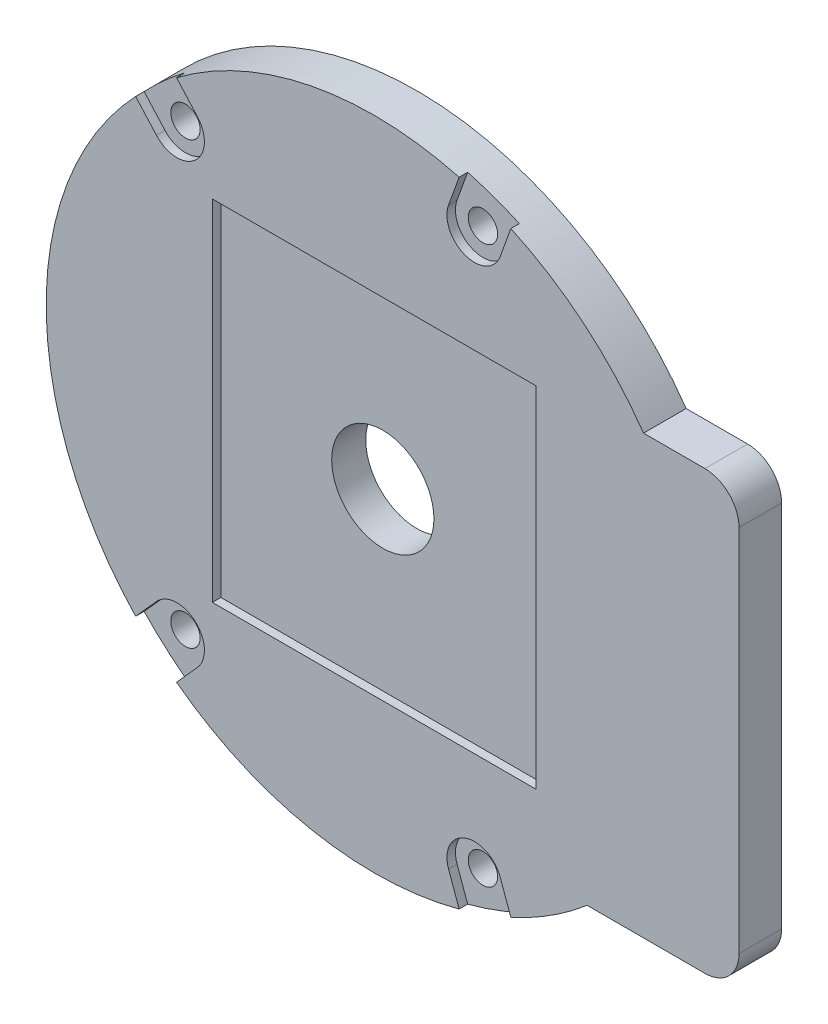
ISO-10303-21;
HEADER;
FILE_DESCRIPTION(('STEP AP214'),'2;1');
FILE_NAME('part.step','',(''),(''),'','','');
FILE_SCHEMA(('AUTOMOTIVE_DESIGN { 1 0 10303 214 1 1 1 1 }'));
ENDSEC;
DATA;
#1=APPLICATION_CONTEXT('core data for automotive mechanical design processes');
#2=APPLICATION_PROTOCOL_DEFINITION('international standard','automotive_design',2000,#1);
#3=PRODUCT_CONTEXT('',#1,'mechanical');
#4=PRODUCT('Part','Part','',(#3));
#5=PRODUCT_RELATED_PRODUCT_CATEGORY('part','',(#4));
#6=PRODUCT_DEFINITION_FORMATION('','',#4);
#7=PRODUCT_DEFINITION_CONTEXT('part definition',#1,'design');
#8=PRODUCT_DEFINITION('design','',#6,#7);
#9=PRODUCT_DEFINITION_SHAPE('','',#8);
#10=(LENGTH_UNIT() NAMED_UNIT(*) SI_UNIT(.MILLI.,.METRE.));
#11=(NAMED_UNIT(*) PLANE_ANGLE_UNIT() SI_UNIT($,.RADIAN.));
#12=(NAMED_UNIT(*) SI_UNIT($,.STERADIAN.) SOLID_ANGLE_UNIT());
#13=UNCERTAINTY_MEASURE_WITH_UNIT(LENGTH_MEASURE(1.E-05),#10,'distance_accuracy_value','');
#14=(GEOMETRIC_REPRESENTATION_CONTEXT(3) GLOBAL_UNCERTAINTY_ASSIGNED_CONTEXT((#13)) GLOBAL_UNIT_ASSIGNED_CONTEXT((#10,
#11,#12)) REPRESENTATION_CONTEXT('',''));
#15=CARTESIAN_POINT('',(0.,0.,0.));
#16=DIRECTION('',(0.,0.,1.));
#17=DIRECTION('',(1.,0.,0.));
#18=AXIS2_PLACEMENT_3D('',#15,#16,#17);
#19=CARTESIAN_POINT('',(0.,0.,4.));
#20=DIRECTION('',(0.,0.,1.));
#21=DIRECTION('',(1.,0.,0.));
#22=AXIS2_PLACEMENT_3D('',#19,#20,#21);
#23=PLANE('',#22);
#24=DIRECTION('',(0.338622846225682,-0.940922190201729,0.));
#25=VECTOR('',#24,1.);
#26=CARTESIAN_POINT('',(14.7846868274317,-31.5579413209222,4.));
#27=LINE('',#26,#25);
#28=CARTESIAN_POINT('',(14.7846868274317,-31.5579413209222,4.));
#29=VERTEX_POINT('',#28);
#30=CARTESIAN_POINT('',(16.0256343042209,-35.0061286798094,4.));
#31=VERTEX_POINT('',#30);
#32=EDGE_CURVE('E256',#29,#31,#27,.T.);
#33=ORIENTED_EDGE('',*,*,#32,.F.);
#34=CARTESIAN_POINT('',(11.7502127640311,-32.65,4.));
#35=DIRECTION('',(0.,0.,-1.));
#36=DIRECTION('',(-1.,0.,0.));
#37=AXIS2_PLACEMENT_3D('',#34,#35,#36);
#38=CIRCLE('',#37,3.225);
#39=CARTESIAN_POINT('',(8.71573870063056,-33.7420586790778,4.));
#40=VERTEX_POINT('',#39);
#41=EDGE_CURVE('E396',#40,#29,#38,.T.);
#42=ORIENTED_EDGE('',*,*,#41,.F.);
#43=DIRECTION('',(-0.338622846225681,0.940922190201729,0.));
#44=VECTOR('',#43,1.);
#45=CARTESIAN_POINT('',(8.71573870063056,-33.7420586790778,4.));
#46=LINE('',#45,#44);
#47=CARTESIAN_POINT('',(9.95668617741978,-37.1902460379651,4.));
#48=VERTEX_POINT('',#47);
#49=EDGE_CURVE('E850',#48,#40,#46,.T.);
#50=ORIENTED_EDGE('',*,*,#49,.F.);
#51=CARTESIAN_POINT('',(0.,0.,4.));
#52=DIRECTION('',(0.,0.,1.));
#53=DIRECTION('',(1.,0.,0.));
#54=AXIS2_PLACEMENT_3D('',#51,#52,#53);
#55=CIRCLE('',#54,38.5);
#56=EDGE_CURVE('E358',#48,#31,#55,.T.);
#57=ORIENTED_EDGE('',*,*,#56,.T.);
#58=EDGE_LOOP('',(#33,#42,#50,#57));
#59=FACE_BOUND('',#58,.T.);
#60=CARTESIAN_POINT('',(11.7502127640311,-32.65,4.));
#61=DIRECTION('',(0.,0.,1.));
#62=DIRECTION('',(1.,0.,0.));
#63=AXIS2_PLACEMENT_3D('',#60,#61,#62);
#64=CIRCLE('',#63,1.725);
#65=CARTESIAN_POINT('',(13.4752127640311,-32.65,4.));
#66=VERTEX_POINT('',#65);
#67=EDGE_CURVE('E440',#66,#66,#64,.T.);
#68=ORIENTED_EDGE('',*,*,#67,.F.);
#69=EDGE_LOOP('',(#68));
#70=FACE_BOUND('',#69,.T.);
#71=ADVANCED_FACE('F32',(#59,#70),#23,.T.);
#72=DIRECTION('',(-0.667434411909216,-0.744668587896253,0.));
#73=VECTOR('',#72,1.);
#74=CARTESIAN_POINT('',(-20.7584178972843,-27.9924759784072,4.));
#75=LINE('',#74,#73);
#76=CARTESIAN_POINT('',(-20.7584178972843,-27.9924759784072,4.));
#77=VERTEX_POINT('',#76);
#78=CARTESIAN_POINT('',(-23.2043575573303,-30.7214548866353,4.));
#79=VERTEX_POINT('',#78);
#80=EDGE_CURVE('E840',#77,#79,#75,.T.);
#81=ORIENTED_EDGE('',*,*,#80,.F.);
#82=CARTESIAN_POINT('',(-23.1599740932498,-25.84,4.));
#83=DIRECTION('',(0.,0.,-1.));
#84=DIRECTION('',(-1.,0.,0.));
#85=AXIS2_PLACEMENT_3D('',#82,#83,#84);
#86=CIRCLE('',#85,3.225);
#87=CARTESIAN_POINT('',(-25.5615302892152,-23.6875240215928,4.));
#88=VERTEX_POINT('',#87);
#89=EDGE_CURVE('E837',#88,#77,#86,.T.);
#90=ORIENTED_EDGE('',*,*,#89,.F.);
#91=DIRECTION('',(0.667434411909216,0.744668587896253,0.));
#92=VECTOR('',#91,1.);
#93=CARTESIAN_POINT('',(-25.5615302892152,-23.6875240215928,4.));
#94=LINE('',#93,#92);
#95=CARTESIAN_POINT('',(-28.0074699492611,-26.4165029298209,4.));
#96=VERTEX_POINT('',#95);
#97=EDGE_CURVE('E865',#96,#88,#94,.T.);
#98=ORIENTED_EDGE('',*,*,#97,.F.);
#99=EDGE_CURVE('E380',#96,#79,#55,.T.);
#100=ORIENTED_EDGE('',*,*,#99,.T.);
#101=EDGE_LOOP('',(#81,#90,#98,#100));
#102=FACE_BOUND('',#101,.T.);
#103=CARTESIAN_POINT('',(-23.1599740932498,-25.84,4.));
#104=DIRECTION('',(0.,0.,1.));
#105=DIRECTION('',(1.,0.,0.));
#106=AXIS2_PLACEMENT_3D('',#103,#104,#105);
#107=CIRCLE('',#106,1.725);
#108=CARTESIAN_POINT('',(-21.4349740932498,-25.84,4.));
#109=VERTEX_POINT('',#108);
#110=EDGE_CURVE('E444',#109,#109,#107,.T.);
#111=ORIENTED_EDGE('',*,*,#110,.F.);
#112=EDGE_LOOP('',(#111));
#113=FACE_BOUND('',#112,.T.);
#114=ADVANCED_FACE('F467',(#102,#113),#23,.T.);
#115=DIRECTION('',(-0.667434411909216,0.744668587896253,0.));
#116=VECTOR('',#115,1.);
#117=CARTESIAN_POINT('',(-25.5615302892152,23.6875240215928,4.));
#118=LINE('',#117,#116);
#119=CARTESIAN_POINT('',(-25.5615302892152,23.6875240215928,4.));
#120=VERTEX_POINT('',#119);
#121=CARTESIAN_POINT('',(-28.0074699492611,26.4165029298209,4.));
#122=VERTEX_POINT('',#121);
#123=EDGE_CURVE('E823',#120,#122,#118,.T.);
#124=ORIENTED_EDGE('',*,*,#123,.F.);
#125=CARTESIAN_POINT('',(-23.1599740932498,25.84,4.));
#126=DIRECTION('',(0.,0.,-1.));
#127=DIRECTION('',(1.,0.,0.));
#128=AXIS2_PLACEMENT_3D('',#125,#126,#127);
#129=CIRCLE('',#128,3.225);
#130=CARTESIAN_POINT('',(-20.7584178972843,27.9924759784072,4.));
#131=VERTEX_POINT('',#130);
#132=EDGE_CURVE('E302',#131,#120,#129,.T.);
#133=ORIENTED_EDGE('',*,*,#132,.F.);
#134=DIRECTION('',(0.667434411909216,-0.744668587896253,0.));
#135=VECTOR('',#134,1.);
#136=CARTESIAN_POINT('',(-20.7584178972843,27.9924759784072,4.));
#137=LINE('',#136,#135);
#138=CARTESIAN_POINT('',(-23.2043575573303,30.7214548866353,4.));
#139=VERTEX_POINT('',#138);
#140=EDGE_CURVE('E308',#139,#131,#137,.T.);
#141=ORIENTED_EDGE('',*,*,#140,.F.);
#142=EDGE_CURVE('E370',#139,#122,#55,.T.);
#143=ORIENTED_EDGE('',*,*,#142,.T.);
#144=EDGE_LOOP('',(#124,#133,#141,#143));
#145=FACE_BOUND('',#144,.T.);
#146=CARTESIAN_POINT('',(-23.1599740932498,25.84,4.));
#147=DIRECTION('',(0.,0.,1.));
#148=DIRECTION('',(1.,0.,0.));
#149=AXIS2_PLACEMENT_3D('',#146,#147,#148);
#150=CIRCLE('',#149,1.725);
#151=CARTESIAN_POINT('',(-21.4349740932498,25.84,4.));
#152=VERTEX_POINT('',#151);
#153=EDGE_CURVE('E434',#152,#152,#150,.T.);
#154=ORIENTED_EDGE('',*,*,#153,.F.);
#155=EDGE_LOOP('',(#154));
#156=FACE_BOUND('',#155,.T.);
#157=ADVANCED_FACE('F473',(#145,#156),#23,.T.);
#158=DIRECTION('',(0.338622846225681,0.940922190201729,0.));
#159=VECTOR('',#158,1.);
#160=CARTESIAN_POINT('',(8.71573870063056,33.7420586790778,4.));
#161=LINE('',#160,#159);
#162=CARTESIAN_POINT('',(8.71573870063056,33.7420586790778,4.));
#163=VERTEX_POINT('',#162);
#164=CARTESIAN_POINT('',(9.95668617741978,37.1902460379651,4.));
#165=VERTEX_POINT('',#164);
#166=EDGE_CURVE('E299',#163,#165,#161,.T.);
#167=ORIENTED_EDGE('',*,*,#166,.F.);
#168=CARTESIAN_POINT('',(11.7502127640311,32.65,4.));
#169=DIRECTION('',(0.,0.,-1.));
#170=DIRECTION('',(1.,0.,0.));
#171=AXIS2_PLACEMENT_3D('',#168,#169,#170);
#172=CIRCLE('',#171,3.225);
#173=CARTESIAN_POINT('',(14.7846868274317,31.5579413209222,4.));
#174=VERTEX_POINT('',#173);
#175=EDGE_CURVE('E296',#174,#163,#172,.T.);
#176=ORIENTED_EDGE('',*,*,#175,.F.);
#177=DIRECTION('',(-0.338622846225682,-0.940922190201729,0.));
#178=VECTOR('',#177,1.);
#179=CARTESIAN_POINT('',(14.7846868274317,31.5579413209222,4.));
#180=LINE('',#179,#178);
#181=CARTESIAN_POINT('',(16.0256343042209,35.0061286798094,4.));
#182=VERTEX_POINT('',#181);
#183=EDGE_CURVE('E226',#182,#174,#180,.T.);
#184=ORIENTED_EDGE('',*,*,#183,.F.);
#185=EDGE_CURVE('E365',#182,#165,#55,.T.);
#186=ORIENTED_EDGE('',*,*,#185,.T.);
#187=EDGE_LOOP('',(#167,#176,#184,#186));
#188=FACE_BOUND('',#187,.T.);
#189=CARTESIAN_POINT('',(11.7502127640311,32.65,4.));
#190=DIRECTION('',(0.,0.,1.));
#191=DIRECTION('',(1.,0.,0.));
#192=AXIS2_PLACEMENT_3D('',#189,#190,#191);
#193=CIRCLE('',#192,1.725);
#194=CARTESIAN_POINT('',(13.4752127640311,32.65,4.));
#195=VERTEX_POINT('',#194);
#196=EDGE_CURVE('E428',#195,#195,#193,.T.);
#197=ORIENTED_EDGE('',*,*,#196,.F.);
#198=EDGE_LOOP('',(#197));
#199=FACE_BOUND('',#198,.T.);
#200=ADVANCED_FACE('F469',(#188,#199),#23,.T.);
#201=CARTESIAN_POINT('',(0.,0.,0.));
#202=DIRECTION('',(0.,0.,1.));
#203=DIRECTION('',(1.,0.,0.));
#204=AXIS2_PLACEMENT_3D('',#201,#202,#203);
#205=PLANE('',#204);
#206=CARTESIAN_POINT('',(0.,0.,0.));
#207=DIRECTION('',(0.,0.,-1.));
#208=DIRECTION('',(-1.,0.,0.));
#209=AXIS2_PLACEMENT_3D('',#206,#207,#208);
#210=CIRCLE('',#209,6.);
#211=CARTESIAN_POINT('',(-6.,0.,0.));
#212=VERTEX_POINT('',#211);
#213=EDGE_CURVE('E320',#212,#212,#210,.T.);
#214=ORIENTED_EDGE('',*,*,#213,.F.);
#215=EDGE_LOOP('',(#214));
#216=FACE_BOUND('',#215,.T.);
#217=CARTESIAN_POINT('',(-23.1599740932498,25.84,0.));
#218=DIRECTION('',(0.,0.,1.));
#219=DIRECTION('',(1.,0.,0.));
#220=AXIS2_PLACEMENT_3D('',#217,#218,#219);
#221=CIRCLE('',#220,1.725);
#222=CARTESIAN_POINT('',(-21.4349740932498,25.84,0.));
#223=VERTEX_POINT('',#222);
#224=EDGE_CURVE('E431',#223,#223,#221,.T.);
#225=ORIENTED_EDGE('',*,*,#224,.T.);
#226=EDGE_LOOP('',(#225));
#227=FACE_BOUND('',#226,.T.);
#228=CARTESIAN_POINT('',(-23.1599740932498,-25.84,0.));
#229=DIRECTION('',(0.,0.,1.));
#230=DIRECTION('',(1.,0.,0.));
#231=AXIS2_PLACEMENT_3D('',#228,#229,#230);
#232=CIRCLE('',#231,1.725);
#233=CARTESIAN_POINT('',(-21.4349740932498,-25.84,0.));
#234=VERTEX_POINT('',#233);
#235=EDGE_CURVE('E374',#234,#234,#232,.T.);
#236=ORIENTED_EDGE('',*,*,#235,.T.);
#237=EDGE_LOOP('',(#236));
#238=FACE_BOUND('',#237,.T.);
#239=DIRECTION('',(-1.,0.,0.));
#240=VECTOR('',#239,1.);
#241=CARTESIAN_POINT('',(31.5950945559592,22.,0.));
#242=LINE('',#241,#240);
#243=CARTESIAN_POINT('',(38.8,22.,0.));
#244=VERTEX_POINT('',#243);
#245=CARTESIAN_POINT('',(31.5950945559592,22.,0.));
#246=VERTEX_POINT('',#245);
#247=EDGE_CURVE('E353',#244,#246,#242,.T.);
#248=ORIENTED_EDGE('',*,*,#247,.F.);
#249=CARTESIAN_POINT('',(38.8,18.,0.));
#250=DIRECTION('',(0.,0.,1.));
#251=DIRECTION('',(1.,0.,0.));
#252=AXIS2_PLACEMENT_3D('',#249,#250,#251);
#253=CIRCLE('',#252,4.);
#254=CARTESIAN_POINT('',(42.8,18.,0.));
#255=VERTEX_POINT('',#254);
#256=EDGE_CURVE('E327',#244,#255,#253,.F.);
#257=ORIENTED_EDGE('',*,*,#256,.T.);
#258=DIRECTION('',(0.,1.,0.));
#259=VECTOR('',#258,1.);
#260=CARTESIAN_POINT('',(42.8,22.,0.));
#261=LINE('',#260,#259);
#262=CARTESIAN_POINT('',(42.8,-25.3,0.));
#263=VERTEX_POINT('',#262);
#264=EDGE_CURVE('E351',#263,#255,#261,.T.);
#265=ORIENTED_EDGE('',*,*,#264,.F.);
#266=CARTESIAN_POINT('',(38.8,-25.3,0.));
#267=DIRECTION('',(0.,0.,1.));
#268=DIRECTION('',(1.,0.,0.));
#269=AXIS2_PLACEMENT_3D('',#266,#267,#268);
#270=CIRCLE('',#269,4.);
#271=CARTESIAN_POINT('',(38.8,-29.3,0.));
#272=VERTEX_POINT('',#271);
#273=EDGE_CURVE('E324',#263,#272,#270,.F.);
#274=ORIENTED_EDGE('',*,*,#273,.T.);
#275=DIRECTION('',(1.,0.,0.));
#276=VECTOR('',#275,1.);
#277=CARTESIAN_POINT('',(42.8,-29.3,0.));
#278=LINE('',#277,#276);
#279=CARTESIAN_POINT('',(24.9751876869824,-29.3,0.));
#280=VERTEX_POINT('',#279);
#281=EDGE_CURVE('E356',#280,#272,#278,.T.);
#282=ORIENTED_EDGE('',*,*,#281,.F.);
#283=CARTESIAN_POINT('',(0.,0.,0.));
#284=DIRECTION('',(0.,0.,1.));
#285=DIRECTION('',(1.,0.,0.));
#286=AXIS2_PLACEMENT_3D('',#283,#284,#285);
#287=CIRCLE('',#286,38.5);
#288=EDGE_CURVE('E360',#246,#280,#287,.T.);
#289=ORIENTED_EDGE('',*,*,#288,.F.);
#290=EDGE_LOOP('',(#248,#257,#265,#274,#282,#289));
#291=FACE_BOUND('',#290,.T.);
#292=CARTESIAN_POINT('',(11.7502127640311,-32.65,0.));
#293=DIRECTION('',(0.,0.,1.));
#294=DIRECTION('',(1.,0.,0.));
#295=AXIS2_PLACEMENT_3D('',#292,#293,#294);
#296=CIRCLE('',#295,1.725);
#297=CARTESIAN_POINT('',(13.4752127640311,-32.65,0.));
#298=VERTEX_POINT('',#297);
#299=EDGE_CURVE('E437',#298,#298,#296,.T.);
#300=ORIENTED_EDGE('',*,*,#299,.T.);
#301=EDGE_LOOP('',(#300));
#302=FACE_BOUND('',#301,.T.);
#303=CARTESIAN_POINT('',(11.7502127640311,32.65,0.));
#304=DIRECTION('',(0.,0.,1.));
#305=DIRECTION('',(1.,0.,0.));
#306=AXIS2_PLACEMENT_3D('',#303,#304,#305);
#307=CIRCLE('',#306,1.725);
#308=CARTESIAN_POINT('',(13.4752127640311,32.65,0.));
#309=VERTEX_POINT('',#308);
#310=EDGE_CURVE('E389',#309,#309,#307,.T.);
#311=ORIENTED_EDGE('',*,*,#310,.T.);
#312=EDGE_LOOP('',(#311));
#313=FACE_BOUND('',#312,.T.);
#314=ADVANCED_FACE('F349',(#216,#227,#238,#291,#302,#313),#205,.F.);
#315=CARTESIAN_POINT('',(0.,0.,4.));
#316=DIRECTION('',(0.,0.,-1.));
#317=DIRECTION('',(-1.,0.,0.));
#318=AXIS2_PLACEMENT_3D('',#315,#316,#317);
#319=CYLINDRICAL_SURFACE('',#318,38.5);
#320=ORIENTED_EDGE('',*,*,#288,.T.);
#321=DIRECTION('',(0.,0.,-1.));
#322=VECTOR('',#321,1.);
#323=CARTESIAN_POINT('',(24.9751876869824,-29.3,4.));
#324=LINE('',#323,#322);
#325=CARTESIAN_POINT('',(24.9751876869824,-29.3,5.));
#326=VERTEX_POINT('',#325);
#327=EDGE_CURVE('E325',#326,#280,#324,.T.);
#328=ORIENTED_EDGE('',*,*,#327,.F.);
#329=CARTESIAN_POINT('',(0.,0.,5.));
#330=DIRECTION('',(0.,0.,1.));
#331=DIRECTION('',(1.,0.,0.));
#332=AXIS2_PLACEMENT_3D('',#329,#330,#331);
#333=CIRCLE('',#332,38.5);
#334=CARTESIAN_POINT('',(16.0256343042209,-35.0061286798094,5.));
#335=VERTEX_POINT('',#334);
#336=EDGE_CURVE('E286',#335,#326,#333,.T.);
#337=ORIENTED_EDGE('',*,*,#336,.F.);
#338=DIRECTION('',(0.,0.,-1.));
#339=VECTOR('',#338,1.);
#340=CARTESIAN_POINT('',(16.0256343042209,-35.0061286798094,5.));
#341=LINE('',#340,#339);
#342=EDGE_CURVE('E295',#335,#31,#341,.T.);
#343=ORIENTED_EDGE('',*,*,#342,.T.);
#344=ORIENTED_EDGE('',*,*,#56,.F.);
#345=DIRECTION('',(0.,0.,-1.));
#346=VECTOR('',#345,1.);
#347=CARTESIAN_POINT('',(9.95668617741978,-37.1902460379651,5.));
#348=LINE('',#347,#346);
#349=CARTESIAN_POINT('',(9.95668617741978,-37.1902460379651,5.));
#350=VERTEX_POINT('',#349);
#351=EDGE_CURVE('E408',#350,#48,#348,.T.);
#352=ORIENTED_EDGE('',*,*,#351,.F.);
#353=CARTESIAN_POINT('',(0.,0.,5.));
#354=DIRECTION('',(0.,0.,1.));
#355=DIRECTION('',(1.,0.,0.));
#356=AXIS2_PLACEMENT_3D('',#353,#354,#355);
#357=CIRCLE('',#356,38.5);
#358=CARTESIAN_POINT('',(-23.2043575573303,-30.7214548866353,5.));
#359=VERTEX_POINT('',#358);
#360=EDGE_CURVE('E278',#359,#350,#357,.T.);
#361=ORIENTED_EDGE('',*,*,#360,.F.);
#362=DIRECTION('',(0.,0.,-1.));
#363=VECTOR('',#362,1.);
#364=CARTESIAN_POINT('',(-23.2043575573303,-30.7214548866353,5.));
#365=LINE('',#364,#363);
#366=EDGE_CURVE('E413',#359,#79,#365,.T.);
#367=ORIENTED_EDGE('',*,*,#366,.T.);
#368=ORIENTED_EDGE('',*,*,#99,.F.);
#369=DIRECTION('',(0.,0.,-1.));
#370=VECTOR('',#369,1.);
#371=CARTESIAN_POINT('',(-28.0074699492611,-26.4165029298209,5.));
#372=LINE('',#371,#370);
#373=CARTESIAN_POINT('',(-28.0074699492611,-26.4165029298209,5.));
#374=VERTEX_POINT('',#373);
#375=EDGE_CURVE('E416',#374,#96,#372,.T.);
#376=ORIENTED_EDGE('',*,*,#375,.F.);
#377=CARTESIAN_POINT('',(0.,0.,5.));
#378=DIRECTION('',(0.,0.,1.));
#379=DIRECTION('',(1.,0.,0.));
#380=AXIS2_PLACEMENT_3D('',#377,#378,#379);
#381=CIRCLE('',#380,38.5);
#382=CARTESIAN_POINT('',(-28.0074699492611,26.4165029298209,5.));
#383=VERTEX_POINT('',#382);
#384=EDGE_CURVE('E270',#383,#374,#381,.T.);
#385=ORIENTED_EDGE('',*,*,#384,.F.);
#386=DIRECTION('',(0.,0.,-1.));
#387=VECTOR('',#386,1.);
#388=CARTESIAN_POINT('',(-28.0074699492611,26.4165029298209,5.));
#389=LINE('',#388,#387);
#390=EDGE_CURVE('E421',#383,#122,#389,.T.);
#391=ORIENTED_EDGE('',*,*,#390,.T.);
#392=ORIENTED_EDGE('',*,*,#142,.F.);
#393=DIRECTION('',(0.,0.,-1.));
#394=VECTOR('',#393,1.);
#395=CARTESIAN_POINT('',(-23.2043575573303,30.7214548866353,5.));
#396=LINE('',#395,#394);
#397=CARTESIAN_POINT('',(-23.2043575573303,30.7214548866353,5.));
#398=VERTEX_POINT('',#397);
#399=EDGE_CURVE('E315',#398,#139,#396,.T.);
#400=ORIENTED_EDGE('',*,*,#399,.F.);
#401=CARTESIAN_POINT('',(0.,0.,5.));
#402=DIRECTION('',(0.,0.,1.));
#403=DIRECTION('',(1.,0.,0.));
#404=AXIS2_PLACEMENT_3D('',#401,#402,#403);
#405=CIRCLE('',#404,38.5);
#406=CARTESIAN_POINT('',(9.95668617741978,37.1902460379651,5.));
#407=VERTEX_POINT('',#406);
#408=EDGE_CURVE('E262',#407,#398,#405,.T.);
#409=ORIENTED_EDGE('',*,*,#408,.F.);
#410=DIRECTION('',(0.,0.,-1.));
#411=VECTOR('',#410,1.);
#412=CARTESIAN_POINT('',(9.95668617741978,37.1902460379651,5.));
#413=LINE('',#412,#411);
#414=EDGE_CURVE('E311',#407,#165,#413,.T.);
#415=ORIENTED_EDGE('',*,*,#414,.T.);
#416=ORIENTED_EDGE('',*,*,#185,.F.);
#417=DIRECTION('',(0.,0.,-1.));
#418=VECTOR('',#417,1.);
#419=CARTESIAN_POINT('',(16.0256343042209,35.0061286798094,5.));
#420=LINE('',#419,#418);
#421=CARTESIAN_POINT('',(16.0256343042209,35.0061286798094,5.));
#422=VERTEX_POINT('',#421);
#423=EDGE_CURVE('E386',#422,#182,#420,.T.);
#424=ORIENTED_EDGE('',*,*,#423,.F.);
#425=CARTESIAN_POINT('',(0.,0.,5.));
#426=DIRECTION('',(0.,0.,1.));
#427=DIRECTION('',(1.,0.,0.));
#428=AXIS2_PLACEMENT_3D('',#425,#426,#427);
#429=CIRCLE('',#428,38.5);
#430=CARTESIAN_POINT('',(31.5950945559592,22.,5.));
#431=VERTEX_POINT('',#430);
#432=EDGE_CURVE('E252',#431,#422,#429,.T.);
#433=ORIENTED_EDGE('',*,*,#432,.F.);
#434=DIRECTION('',(0.,0.,-1.));
#435=VECTOR('',#434,1.);
#436=CARTESIAN_POINT('',(31.5950945559592,22.,4.));
#437=LINE('',#436,#435);
#438=EDGE_CURVE('E344',#431,#246,#437,.T.);
#439=ORIENTED_EDGE('',*,*,#438,.T.);
#440=EDGE_LOOP('',(#320,#328,#337,#343,#344,#352,#361,#367,#368,#376,#385,#391,#392,#400,#409,
#415,#416,#424,#433,#439));
#441=FACE_BOUND('',#440,.T.);
#442=ADVANCED_FACE('F484',(#441),#319,.T.);
#443=CARTESIAN_POINT('',(42.8,-29.3,4.));
#444=DIRECTION('',(0.,1.,0.));
#445=DIRECTION('',(-1.,0.,0.));
#446=AXIS2_PLACEMENT_3D('',#443,#444,#445);
#447=PLANE('',#446);
#448=ORIENTED_EDGE('',*,*,#281,.T.);
#449=DIRECTION('',(0.,0.,-1.));
#450=VECTOR('',#449,1.);
#451=CARTESIAN_POINT('',(38.8,-29.3,4.));
#452=LINE('',#451,#450);
#453=CARTESIAN_POINT('',(38.8,-29.3,5.));
#454=VERTEX_POINT('',#453);
#455=EDGE_CURVE('E11',#272,#454,#452,.F.);
#456=ORIENTED_EDGE('',*,*,#455,.T.);
#457=DIRECTION('',(1.,0.,0.));
#458=VECTOR('',#457,1.);
#459=CARTESIAN_POINT('',(42.8,-29.3,5.));
#460=LINE('',#459,#458);
#461=EDGE_CURVE('E289',#326,#454,#460,.T.);
#462=ORIENTED_EDGE('',*,*,#461,.F.);
#463=ORIENTED_EDGE('',*,*,#327,.T.);
#464=EDGE_LOOP('',(#448,#456,#462,#463));
#465=FACE_BOUND('',#464,.T.);
#466=ADVANCED_FACE('F684',(#465),#447,.F.);
#467=CARTESIAN_POINT('',(42.8,22.,4.));
#468=DIRECTION('',(-1.,0.,0.));
#469=DIRECTION('',(0.,-1.,0.));
#470=AXIS2_PLACEMENT_3D('',#467,#468,#469);
#471=PLANE('',#470);
#472=ORIENTED_EDGE('',*,*,#264,.T.);
#473=DIRECTION('',(0.,0.,-1.));
#474=VECTOR('',#473,1.);
#475=CARTESIAN_POINT('',(42.8,18.,4.));
#476=LINE('',#475,#474);
#477=CARTESIAN_POINT('',(42.8,18.,5.));
#478=VERTEX_POINT('',#477);
#479=EDGE_CURVE('E53',#255,#478,#476,.F.);
#480=ORIENTED_EDGE('',*,*,#479,.T.);
#481=DIRECTION('',(0.,1.,0.));
#482=VECTOR('',#481,1.);
#483=CARTESIAN_POINT('',(42.8,22.,5.));
#484=LINE('',#483,#482);
#485=CARTESIAN_POINT('',(42.8,-25.3,5.));
#486=VERTEX_POINT('',#485);
#487=EDGE_CURVE('E291',#486,#478,#484,.T.);
#488=ORIENTED_EDGE('',*,*,#487,.F.);
#489=DIRECTION('',(0.,0.,-1.));
#490=VECTOR('',#489,1.);
#491=CARTESIAN_POINT('',(42.8,-25.3,4.));
#492=LINE('',#491,#490);
#493=EDGE_CURVE('E329',#486,#263,#492,.T.);
#494=ORIENTED_EDGE('',*,*,#493,.T.);
#495=EDGE_LOOP('',(#472,#480,#488,#494));
#496=FACE_BOUND('',#495,.T.);
#497=ADVANCED_FACE('F354',(#496),#471,.F.);
#498=CARTESIAN_POINT('',(31.5950945559592,22.,4.));
#499=DIRECTION('',(0.,-1.,0.));
#500=DIRECTION('',(0.,0.,-1.));
#501=AXIS2_PLACEMENT_3D('',#498,#499,#500);
#502=PLANE('',#501);
#503=DIRECTION('',(-1.,0.,0.));
#504=VECTOR('',#503,1.);
#505=CARTESIAN_POINT('',(31.5950945559592,22.,5.));
#506=LINE('',#505,#504);
#507=CARTESIAN_POINT('',(38.8,22.,5.));
#508=VERTEX_POINT('',#507);
#509=EDGE_CURVE('E293',#508,#431,#506,.T.);
#510=ORIENTED_EDGE('',*,*,#509,.F.);
#511=DIRECTION('',(0.,0.,-1.));
#512=VECTOR('',#511,1.);
#513=CARTESIAN_POINT('',(38.8,22.,4.));
#514=LINE('',#513,#512);
#515=EDGE_CURVE('E321',#508,#244,#514,.T.);
#516=ORIENTED_EDGE('',*,*,#515,.T.);
#517=ORIENTED_EDGE('',*,*,#247,.T.);
#518=ORIENTED_EDGE('',*,*,#438,.F.);
#519=EDGE_LOOP('',(#510,#516,#517,#518));
#520=FACE_BOUND('',#519,.T.);
#521=ADVANCED_FACE('F341',(#520),#502,.F.);
#522=CARTESIAN_POINT('',(-23.1599740932498,-25.84,4.));
#523=DIRECTION('',(0.,0.,-1.));
#524=DIRECTION('',(-1.,0.,0.));
#525=AXIS2_PLACEMENT_3D('',#522,#523,#524);
#526=CYLINDRICAL_SURFACE('',#525,1.725);
#527=ORIENTED_EDGE('',*,*,#110,.T.);
#528=EDGE_LOOP('',(#527));
#529=FACE_BOUND('',#528,.T.);
#530=ORIENTED_EDGE('',*,*,#235,.F.);
#531=EDGE_LOOP('',(#530));
#532=FACE_BOUND('',#531,.T.);
#533=ADVANCED_FACE('F453',(#529,#532),#526,.F.);
#534=CARTESIAN_POINT('',(11.7502127640311,-32.65,4.));
#535=DIRECTION('',(0.,0.,-1.));
#536=DIRECTION('',(-1.,0.,0.));
#537=AXIS2_PLACEMENT_3D('',#534,#535,#536);
#538=CYLINDRICAL_SURFACE('',#537,1.725);
#539=ORIENTED_EDGE('',*,*,#67,.T.);
#540=EDGE_LOOP('',(#539));
#541=FACE_BOUND('',#540,.T.);
#542=ORIENTED_EDGE('',*,*,#299,.F.);
#543=EDGE_LOOP('',(#542));
#544=FACE_BOUND('',#543,.T.);
#545=ADVANCED_FACE('F455',(#541,#544),#538,.F.);
#546=CARTESIAN_POINT('',(-23.1599740932498,25.84,4.));
#547=DIRECTION('',(0.,0.,-1.));
#548=DIRECTION('',(-1.,0.,0.));
#549=AXIS2_PLACEMENT_3D('',#546,#547,#548);
#550=CYLINDRICAL_SURFACE('',#549,1.725);
#551=ORIENTED_EDGE('',*,*,#153,.T.);
#552=EDGE_LOOP('',(#551));
#553=FACE_BOUND('',#552,.T.);
#554=ORIENTED_EDGE('',*,*,#224,.F.);
#555=EDGE_LOOP('',(#554));
#556=FACE_BOUND('',#555,.T.);
#557=ADVANCED_FACE('F461',(#553,#556),#550,.F.);
#558=CARTESIAN_POINT('',(11.7502127640311,32.65,4.));
#559=DIRECTION('',(0.,0.,-1.));
#560=DIRECTION('',(-1.,0.,0.));
#561=AXIS2_PLACEMENT_3D('',#558,#559,#560);
#562=CYLINDRICAL_SURFACE('',#561,1.725);
#563=ORIENTED_EDGE('',*,*,#196,.T.);
#564=EDGE_LOOP('',(#563));
#565=FACE_BOUND('',#564,.T.);
#566=ORIENTED_EDGE('',*,*,#310,.F.);
#567=EDGE_LOOP('',(#566));
#568=FACE_BOUND('',#567,.T.);
#569=ADVANCED_FACE('F519',(#565,#568),#562,.F.);
#570=CARTESIAN_POINT('',(0.,0.,5.));
#571=DIRECTION('',(0.,0.,1.));
#572=DIRECTION('',(1.,0.,0.));
#573=AXIS2_PLACEMENT_3D('',#570,#571,#572);
#574=PLANE('',#573);
#575=ORIENTED_EDGE('',*,*,#487,.T.);
#576=CARTESIAN_POINT('',(38.8,18.,5.));
#577=DIRECTION('',(0.,0.,1.));
#578=DIRECTION('',(1.,0.,0.));
#579=AXIS2_PLACEMENT_3D('',#576,#577,#578);
#580=CIRCLE('',#579,4.);
#581=EDGE_CURVE('E40',#478,#508,#580,.T.);
#582=ORIENTED_EDGE('',*,*,#581,.T.);
#583=ORIENTED_EDGE('',*,*,#509,.T.);
#584=ORIENTED_EDGE('',*,*,#432,.T.);
#585=DIRECTION('',(-0.338622846225682,-0.940922190201729,0.));
#586=VECTOR('',#585,1.);
#587=CARTESIAN_POINT('',(14.7846868274317,31.5579413209222,5.));
#588=LINE('',#587,#586);
#589=CARTESIAN_POINT('',(14.7846868274317,31.5579413209222,5.));
#590=VERTEX_POINT('',#589);
#591=EDGE_CURVE('E255',#422,#590,#588,.T.);
#592=ORIENTED_EDGE('',*,*,#591,.T.);
#593=CARTESIAN_POINT('',(11.7502127640311,32.65,5.));
#594=DIRECTION('',(0.,0.,-1.));
#595=DIRECTION('',(1.,0.,0.));
#596=AXIS2_PLACEMENT_3D('',#593,#594,#595);
#597=CIRCLE('',#596,3.225);
#598=CARTESIAN_POINT('',(8.71573870063056,33.7420586790778,5.));
#599=VERTEX_POINT('',#598);
#600=EDGE_CURVE('E258',#590,#599,#597,.T.);
#601=ORIENTED_EDGE('',*,*,#600,.T.);
#602=DIRECTION('',(0.338622846225681,0.940922190201729,0.));
#603=VECTOR('',#602,1.);
#604=CARTESIAN_POINT('',(8.71573870063056,33.7420586790778,5.));
#605=LINE('',#604,#603);
#606=EDGE_CURVE('E260',#599,#407,#605,.T.);
#607=ORIENTED_EDGE('',*,*,#606,.T.);
#608=ORIENTED_EDGE('',*,*,#408,.T.);
#609=DIRECTION('',(0.667434411909216,-0.744668587896253,0.));
#610=VECTOR('',#609,1.);
#611=CARTESIAN_POINT('',(-20.7584178972843,27.9924759784072,5.));
#612=LINE('',#611,#610);
#613=CARTESIAN_POINT('',(-20.7584178972843,27.9924759784072,5.));
#614=VERTEX_POINT('',#613);
#615=EDGE_CURVE('E264',#398,#614,#612,.T.);
#616=ORIENTED_EDGE('',*,*,#615,.T.);
#617=CARTESIAN_POINT('',(-23.1599740932498,25.84,5.));
#618=DIRECTION('',(0.,0.,-1.));
#619=DIRECTION('',(1.,0.,0.));
#620=AXIS2_PLACEMENT_3D('',#617,#618,#619);
#621=CIRCLE('',#620,3.225);
#622=CARTESIAN_POINT('',(-25.5615302892152,23.6875240215928,5.));
#623=VERTEX_POINT('',#622);
#624=EDGE_CURVE('E266',#614,#623,#621,.T.);
#625=ORIENTED_EDGE('',*,*,#624,.T.);
#626=DIRECTION('',(-0.667434411909216,0.744668587896253,0.));
#627=VECTOR('',#626,1.);
#628=CARTESIAN_POINT('',(-25.5615302892152,23.6875240215928,5.));
#629=LINE('',#628,#627);
#630=EDGE_CURVE('E268',#623,#383,#629,.T.);
#631=ORIENTED_EDGE('',*,*,#630,.T.);
#632=ORIENTED_EDGE('',*,*,#384,.T.);
#633=DIRECTION('',(0.667434411909216,0.744668587896253,0.));
#634=VECTOR('',#633,1.);
#635=CARTESIAN_POINT('',(-25.5615302892152,-23.6875240215928,5.));
#636=LINE('',#635,#634);
#637=CARTESIAN_POINT('',(-25.5615302892152,-23.6875240215928,5.));
#638=VERTEX_POINT('',#637);
#639=EDGE_CURVE('E272',#374,#638,#636,.T.);
#640=ORIENTED_EDGE('',*,*,#639,.T.);
#641=CARTESIAN_POINT('',(-23.1599740932498,-25.84,5.));
#642=DIRECTION('',(0.,0.,-1.));
#643=DIRECTION('',(-1.,0.,0.));
#644=AXIS2_PLACEMENT_3D('',#641,#642,#643);
#645=CIRCLE('',#644,3.225);
#646=CARTESIAN_POINT('',(-20.7584178972843,-27.9924759784072,5.));
#647=VERTEX_POINT('',#646);
#648=EDGE_CURVE('E274',#638,#647,#645,.T.);
#649=ORIENTED_EDGE('',*,*,#648,.T.);
#650=DIRECTION('',(-0.667434411909216,-0.744668587896253,0.));
#651=VECTOR('',#650,1.);
#652=CARTESIAN_POINT('',(-20.7584178972843,-27.9924759784072,5.));
#653=LINE('',#652,#651);
#654=EDGE_CURVE('E276',#647,#359,#653,.T.);
#655=ORIENTED_EDGE('',*,*,#654,.T.);
#656=ORIENTED_EDGE('',*,*,#360,.T.);
#657=DIRECTION('',(-0.338622846225681,0.940922190201729,0.));
#658=VECTOR('',#657,1.);
#659=CARTESIAN_POINT('',(8.71573870063056,-33.7420586790778,5.));
#660=LINE('',#659,#658);
#661=CARTESIAN_POINT('',(8.71573870063056,-33.7420586790778,5.));
#662=VERTEX_POINT('',#661);
#663=EDGE_CURVE('E280',#350,#662,#660,.T.);
#664=ORIENTED_EDGE('',*,*,#663,.T.);
#665=CARTESIAN_POINT('',(11.7502127640311,-32.65,5.));
#666=DIRECTION('',(0.,0.,-1.));
#667=DIRECTION('',(-1.,0.,0.));
#668=AXIS2_PLACEMENT_3D('',#665,#666,#667);
#669=CIRCLE('',#668,3.225);
#670=CARTESIAN_POINT('',(14.7846868274317,-31.5579413209222,5.));
#671=VERTEX_POINT('',#670);
#672=EDGE_CURVE('E282',#662,#671,#669,.T.);
#673=ORIENTED_EDGE('',*,*,#672,.T.);
#674=DIRECTION('',(0.338622846225682,-0.940922190201729,0.));
#675=VECTOR('',#674,1.);
#676=CARTESIAN_POINT('',(14.7846868274317,-31.5579413209222,5.));
#677=LINE('',#676,#675);
#678=EDGE_CURVE('E284',#671,#335,#677,.T.);
#679=ORIENTED_EDGE('',*,*,#678,.T.);
#680=ORIENTED_EDGE('',*,*,#336,.T.);
#681=ORIENTED_EDGE('',*,*,#461,.T.);
#682=CARTESIAN_POINT('',(38.8,-25.3,5.));
#683=DIRECTION('',(0.,0.,1.));
#684=DIRECTION('',(1.,0.,0.));
#685=AXIS2_PLACEMENT_3D('',#682,#683,#684);
#686=CIRCLE('',#685,4.);
#687=EDGE_CURVE('E333',#454,#486,#686,.T.);
#688=ORIENTED_EDGE('',*,*,#687,.T.);
#689=EDGE_LOOP('',(#575,#582,#583,#584,#592,#601,#607,#608,#616,#625,#631,#632,#640,#649,#655,
#656,#664,#673,#679,#680,#681,#688));
#690=FACE_BOUND('',#689,.T.);
#691=DIRECTION('',(-1.,0.,0.));
#692=VECTOR('',#691,1.);
#693=CARTESIAN_POINT('',(-19.,20.5,5.));
#694=LINE('',#693,#692);
#695=CARTESIAN_POINT('',(19.,20.5,5.));
#696=VERTEX_POINT('',#695);
#697=CARTESIAN_POINT('',(-19.,20.5,5.));
#698=VERTEX_POINT('',#697);
#699=EDGE_CURVE('E218',#696,#698,#694,.T.);
#700=ORIENTED_EDGE('',*,*,#699,.F.);
#701=DIRECTION('',(0.,1.,0.));
#702=VECTOR('',#701,1.);
#703=CARTESIAN_POINT('',(19.,20.5,5.));
#704=LINE('',#703,#702);
#705=CARTESIAN_POINT('',(19.,-20.5,5.));
#706=VERTEX_POINT('',#705);
#707=EDGE_CURVE('E208',#706,#696,#704,.T.);
#708=ORIENTED_EDGE('',*,*,#707,.F.);
#709=DIRECTION('',(1.,0.,0.));
#710=VECTOR('',#709,1.);
#711=CARTESIAN_POINT('',(-19.,-20.5,5.));
#712=LINE('',#711,#710);
#713=CARTESIAN_POINT('',(-19.,-20.5,5.));
#714=VERTEX_POINT('',#713);
#715=EDGE_CURVE('E234',#714,#706,#712,.T.);
#716=ORIENTED_EDGE('',*,*,#715,.F.);
#717=DIRECTION('',(0.,-1.,0.));
#718=VECTOR('',#717,1.);
#719=CARTESIAN_POINT('',(-19.,20.5,5.));
#720=LINE('',#719,#718);
#721=EDGE_CURVE('E232',#698,#714,#720,.T.);
#722=ORIENTED_EDGE('',*,*,#721,.F.);
#723=EDGE_LOOP('',(#700,#708,#716,#722));
#724=FACE_BOUND('',#723,.T.);
#725=ADVANCED_FACE('F230',(#690,#724),#574,.T.);
#726=CARTESIAN_POINT('',(14.7846868274317,31.5579413209222,5.));
#727=DIRECTION('',(0.940922190201729,-0.338622846225682,0.));
#728=DIRECTION('',(0.338622846225682,0.940922190201729,0.));
#729=AXIS2_PLACEMENT_3D('',#726,#727,#728);
#730=PLANE('',#729);
#731=ORIENTED_EDGE('',*,*,#183,.T.);
#732=DIRECTION('',(0.,0.,-1.));
#733=VECTOR('',#732,1.);
#734=CARTESIAN_POINT('',(14.7846868274317,31.5579413209222,5.));
#735=LINE('',#734,#733);
#736=EDGE_CURVE('E390',#590,#174,#735,.T.);
#737=ORIENTED_EDGE('',*,*,#736,.F.);
#738=ORIENTED_EDGE('',*,*,#591,.F.);
#739=ORIENTED_EDGE('',*,*,#423,.T.);
#740=EDGE_LOOP('',(#731,#737,#738,#739));
#741=FACE_BOUND('',#740,.T.);
#742=ADVANCED_FACE('F518',(#741),#730,.F.);
#743=CARTESIAN_POINT('',(11.7502127640311,32.65,5.));
#744=DIRECTION('',(0.,0.,-1.));
#745=DIRECTION('',(-1.,0.,0.));
#746=AXIS2_PLACEMENT_3D('',#743,#744,#745);
#747=CYLINDRICAL_SURFACE('',#746,3.225);
#748=ORIENTED_EDGE('',*,*,#175,.T.);
#749=DIRECTION('',(0.,0.,-1.));
#750=VECTOR('',#749,1.);
#751=CARTESIAN_POINT('',(8.71573870063056,33.7420586790778,5.));
#752=LINE('',#751,#750);
#753=EDGE_CURVE('E314',#599,#163,#752,.T.);
#754=ORIENTED_EDGE('',*,*,#753,.F.);
#755=ORIENTED_EDGE('',*,*,#600,.F.);
#756=ORIENTED_EDGE('',*,*,#736,.T.);
#757=EDGE_LOOP('',(#748,#754,#755,#756));
#758=FACE_BOUND('',#757,.T.);
#759=ADVANCED_FACE('F558',(#758),#747,.F.);
#760=CARTESIAN_POINT('',(8.71573870063056,33.7420586790778,5.));
#761=DIRECTION('',(-0.940922190201729,0.338622846225681,0.));
#762=DIRECTION('',(-0.338622846225681,-0.940922190201729,0.));
#763=AXIS2_PLACEMENT_3D('',#760,#761,#762);
#764=PLANE('',#763);
#765=ORIENTED_EDGE('',*,*,#166,.T.);
#766=ORIENTED_EDGE('',*,*,#414,.F.);
#767=ORIENTED_EDGE('',*,*,#606,.F.);
#768=ORIENTED_EDGE('',*,*,#753,.T.);
#769=EDGE_LOOP('',(#765,#766,#767,#768));
#770=FACE_BOUND('',#769,.T.);
#771=ADVANCED_FACE('F554',(#770),#764,.F.);
#772=CARTESIAN_POINT('',(-20.7584178972843,27.9924759784072,5.));
#773=DIRECTION('',(0.744668587896253,0.667434411909216,0.));
#774=DIRECTION('',(-0.667434411909216,0.744668587896253,0.));
#775=AXIS2_PLACEMENT_3D('',#772,#773,#774);
#776=PLANE('',#775);
#777=ORIENTED_EDGE('',*,*,#140,.T.);
#778=DIRECTION('',(0.,0.,-1.));
#779=VECTOR('',#778,1.);
#780=CARTESIAN_POINT('',(-20.7584178972843,27.9924759784072,5.));
#781=LINE('',#780,#779);
#782=EDGE_CURVE('E420',#614,#131,#781,.T.);
#783=ORIENTED_EDGE('',*,*,#782,.F.);
#784=ORIENTED_EDGE('',*,*,#615,.F.);
#785=ORIENTED_EDGE('',*,*,#399,.T.);
#786=EDGE_LOOP('',(#777,#783,#784,#785));
#787=FACE_BOUND('',#786,.T.);
#788=ADVANCED_FACE('F550',(#787),#776,.F.);
#789=CARTESIAN_POINT('',(-23.1599740932498,25.84,5.));
#790=DIRECTION('',(0.,0.,-1.));
#791=DIRECTION('',(-1.,0.,0.));
#792=AXIS2_PLACEMENT_3D('',#789,#790,#791);
#793=CYLINDRICAL_SURFACE('',#792,3.225);
#794=ORIENTED_EDGE('',*,*,#132,.T.);
#795=DIRECTION('',(0.,0.,-1.));
#796=VECTOR('',#795,1.);
#797=CARTESIAN_POINT('',(-25.5615302892152,23.6875240215928,5.));
#798=LINE('',#797,#796);
#799=EDGE_CURVE('E417',#623,#120,#798,.T.);
#800=ORIENTED_EDGE('',*,*,#799,.F.);
#801=ORIENTED_EDGE('',*,*,#624,.F.);
#802=ORIENTED_EDGE('',*,*,#782,.T.);
#803=EDGE_LOOP('',(#794,#800,#801,#802));
#804=FACE_BOUND('',#803,.T.);
#805=ADVANCED_FACE('F546',(#804),#793,.F.);
#806=CARTESIAN_POINT('',(-25.5615302892152,23.6875240215928,5.));
#807=DIRECTION('',(-0.744668587896253,-0.667434411909216,0.));
#808=DIRECTION('',(0.667434411909216,-0.744668587896253,0.));
#809=AXIS2_PLACEMENT_3D('',#806,#807,#808);
#810=PLANE('',#809);
#811=ORIENTED_EDGE('',*,*,#123,.T.);
#812=ORIENTED_EDGE('',*,*,#390,.F.);
#813=ORIENTED_EDGE('',*,*,#630,.F.);
#814=ORIENTED_EDGE('',*,*,#799,.T.);
#815=EDGE_LOOP('',(#811,#812,#813,#814));
#816=FACE_BOUND('',#815,.T.);
#817=ADVANCED_FACE('F542',(#816),#810,.F.);
#818=CARTESIAN_POINT('',(-25.5615302892152,-23.6875240215928,5.));
#819=DIRECTION('',(-0.744668587896253,0.667434411909216,0.));
#820=DIRECTION('',(-0.667434411909216,-0.744668587896253,0.));
#821=AXIS2_PLACEMENT_3D('',#818,#819,#820);
#822=PLANE('',#821);
#823=ORIENTED_EDGE('',*,*,#97,.T.);
#824=DIRECTION('',(0.,0.,-1.));
#825=VECTOR('',#824,1.);
#826=CARTESIAN_POINT('',(-25.5615302892152,-23.6875240215928,5.));
#827=LINE('',#826,#825);
#828=EDGE_CURVE('E412',#638,#88,#827,.T.);
#829=ORIENTED_EDGE('',*,*,#828,.F.);
#830=ORIENTED_EDGE('',*,*,#639,.F.);
#831=ORIENTED_EDGE('',*,*,#375,.T.);
#832=EDGE_LOOP('',(#823,#829,#830,#831));
#833=FACE_BOUND('',#832,.T.);
#834=ADVANCED_FACE('F538',(#833),#822,.F.);
#835=CARTESIAN_POINT('',(-23.1599740932498,-25.84,5.));
#836=DIRECTION('',(0.,0.,-1.));
#837=DIRECTION('',(-1.,0.,0.));
#838=AXIS2_PLACEMENT_3D('',#835,#836,#837);
#839=CYLINDRICAL_SURFACE('',#838,3.225);
#840=ORIENTED_EDGE('',*,*,#89,.T.);
#841=DIRECTION('',(0.,0.,-1.));
#842=VECTOR('',#841,1.);
#843=CARTESIAN_POINT('',(-20.7584178972843,-27.9924759784072,5.));
#844=LINE('',#843,#842);
#845=EDGE_CURVE('E409',#647,#77,#844,.T.);
#846=ORIENTED_EDGE('',*,*,#845,.F.);
#847=ORIENTED_EDGE('',*,*,#648,.F.);
#848=ORIENTED_EDGE('',*,*,#828,.T.);
#849=EDGE_LOOP('',(#840,#846,#847,#848));
#850=FACE_BOUND('',#849,.T.);
#851=ADVANCED_FACE('F534',(#850),#839,.F.);
#852=CARTESIAN_POINT('',(-20.7584178972843,-27.9924759784072,5.));
#853=DIRECTION('',(0.744668587896253,-0.667434411909216,0.));
#854=DIRECTION('',(0.667434411909216,0.744668587896253,0.));
#855=AXIS2_PLACEMENT_3D('',#852,#853,#854);
#856=PLANE('',#855);
#857=ORIENTED_EDGE('',*,*,#80,.T.);
#858=ORIENTED_EDGE('',*,*,#366,.F.);
#859=ORIENTED_EDGE('',*,*,#654,.F.);
#860=ORIENTED_EDGE('',*,*,#845,.T.);
#861=EDGE_LOOP('',(#857,#858,#859,#860));
#862=FACE_BOUND('',#861,.T.);
#863=ADVANCED_FACE('F530',(#862),#856,.F.);
#864=CARTESIAN_POINT('',(8.71573870063056,-33.7420586790778,5.));
#865=DIRECTION('',(-0.940922190201729,-0.338622846225681,0.));
#866=DIRECTION('',(0.338622846225681,-0.940922190201729,0.));
#867=AXIS2_PLACEMENT_3D('',#864,#865,#866);
#868=PLANE('',#867);
#869=ORIENTED_EDGE('',*,*,#49,.T.);
#870=DIRECTION('',(0.,0.,-1.));
#871=VECTOR('',#870,1.);
#872=CARTESIAN_POINT('',(8.71573870063056,-33.7420586790778,5.));
#873=LINE('',#872,#871);
#874=EDGE_CURVE('E405',#662,#40,#873,.T.);
#875=ORIENTED_EDGE('',*,*,#874,.F.);
#876=ORIENTED_EDGE('',*,*,#663,.F.);
#877=ORIENTED_EDGE('',*,*,#351,.T.);
#878=EDGE_LOOP('',(#869,#875,#876,#877));
#879=FACE_BOUND('',#878,.T.);
#880=ADVANCED_FACE('F526',(#879),#868,.F.);
#881=CARTESIAN_POINT('',(11.7502127640311,-32.65,5.));
#882=DIRECTION('',(0.,0.,-1.));
#883=DIRECTION('',(-1.,0.,0.));
#884=AXIS2_PLACEMENT_3D('',#881,#882,#883);
#885=CYLINDRICAL_SURFACE('',#884,3.225);
#886=ORIENTED_EDGE('',*,*,#41,.T.);
#887=DIRECTION('',(0.,0.,-1.));
#888=VECTOR('',#887,1.);
#889=CARTESIAN_POINT('',(14.7846868274317,-31.5579413209222,5.));
#890=LINE('',#889,#888);
#891=EDGE_CURVE('E402',#671,#29,#890,.T.);
#892=ORIENTED_EDGE('',*,*,#891,.F.);
#893=ORIENTED_EDGE('',*,*,#672,.F.);
#894=ORIENTED_EDGE('',*,*,#874,.T.);
#895=EDGE_LOOP('',(#886,#892,#893,#894));
#896=FACE_BOUND('',#895,.T.);
#897=ADVANCED_FACE('F522',(#896),#885,.F.);
#898=CARTESIAN_POINT('',(14.7846868274317,-31.5579413209222,5.));
#899=DIRECTION('',(0.940922190201729,0.338622846225682,0.));
#900=DIRECTION('',(-0.338622846225682,0.940922190201729,0.));
#901=AXIS2_PLACEMENT_3D('',#898,#899,#900);
#902=PLANE('',#901);
#903=ORIENTED_EDGE('',*,*,#32,.T.);
#904=ORIENTED_EDGE('',*,*,#342,.F.);
#905=ORIENTED_EDGE('',*,*,#678,.F.);
#906=ORIENTED_EDGE('',*,*,#891,.T.);
#907=EDGE_LOOP('',(#903,#904,#905,#906));
#908=FACE_BOUND('',#907,.T.);
#909=ADVANCED_FACE('F515',(#908),#902,.F.);
#910=CARTESIAN_POINT('',(19.,20.5,5.));
#911=DIRECTION('',(-1.,0.,0.));
#912=DIRECTION('',(0.,-1.,0.));
#913=AXIS2_PLACEMENT_3D('',#910,#911,#912);
#914=PLANE('',#913);
#915=DIRECTION('',(0.,1.,0.));
#916=VECTOR('',#915,1.);
#917=CARTESIAN_POINT('',(19.,20.5,4.));
#918=LINE('',#917,#916);
#919=CARTESIAN_POINT('',(19.,-20.5,4.));
#920=VERTEX_POINT('',#919);
#921=CARTESIAN_POINT('',(19.,20.5,4.));
#922=VERTEX_POINT('',#921);
#923=EDGE_CURVE('E239',#920,#922,#918,.T.);
#924=ORIENTED_EDGE('',*,*,#923,.F.);
#925=DIRECTION('',(0.,0.,-1.));
#926=VECTOR('',#925,1.);
#927=CARTESIAN_POINT('',(19.,-20.5,5.));
#928=LINE('',#927,#926);
#929=EDGE_CURVE('E214',#706,#920,#928,.T.);
#930=ORIENTED_EDGE('',*,*,#929,.F.);
#931=ORIENTED_EDGE('',*,*,#707,.T.);
#932=DIRECTION('',(0.,0.,-1.));
#933=VECTOR('',#932,1.);
#934=CARTESIAN_POINT('',(19.,20.5,5.));
#935=LINE('',#934,#933);
#936=EDGE_CURVE('E212',#696,#922,#935,.T.);
#937=ORIENTED_EDGE('',*,*,#936,.T.);
#938=EDGE_LOOP('',(#924,#930,#931,#937));
#939=FACE_BOUND('',#938,.T.);
#940=ADVANCED_FACE('F211',(#939),#914,.T.);
#941=CARTESIAN_POINT('',(-19.,20.5,5.));
#942=DIRECTION('',(0.,-1.,0.));
#943=DIRECTION('',(0.,0.,-1.));
#944=AXIS2_PLACEMENT_3D('',#941,#942,#943);
#945=PLANE('',#944);
#946=DIRECTION('',(-1.,0.,0.));
#947=VECTOR('',#946,1.);
#948=CARTESIAN_POINT('',(-19.,20.5,4.));
#949=LINE('',#948,#947);
#950=CARTESIAN_POINT('',(-19.,20.5,4.));
#951=VERTEX_POINT('',#950);
#952=EDGE_CURVE('E225',#922,#951,#949,.T.);
#953=ORIENTED_EDGE('',*,*,#952,.F.);
#954=ORIENTED_EDGE('',*,*,#936,.F.);
#955=ORIENTED_EDGE('',*,*,#699,.T.);
#956=DIRECTION('',(0.,0.,-1.));
#957=VECTOR('',#956,1.);
#958=CARTESIAN_POINT('',(-19.,20.5,5.));
#959=LINE('',#958,#957);
#960=EDGE_CURVE('E227',#698,#951,#959,.T.);
#961=ORIENTED_EDGE('',*,*,#960,.T.);
#962=EDGE_LOOP('',(#953,#954,#955,#961));
#963=FACE_BOUND('',#962,.T.);
#964=ADVANCED_FACE('F222',(#963),#945,.T.);
#965=CARTESIAN_POINT('',(-19.,20.5,5.));
#966=DIRECTION('',(1.,0.,0.));
#967=DIRECTION('',(0.,1.,0.));
#968=AXIS2_PLACEMENT_3D('',#965,#966,#967);
#969=PLANE('',#968);
#970=DIRECTION('',(0.,-1.,0.));
#971=VECTOR('',#970,1.);
#972=CARTESIAN_POINT('',(-19.,20.5,4.));
#973=LINE('',#972,#971);
#974=CARTESIAN_POINT('',(-19.,-20.5,4.));
#975=VERTEX_POINT('',#974);
#976=EDGE_CURVE('E243',#951,#975,#973,.T.);
#977=ORIENTED_EDGE('',*,*,#976,.F.);
#978=ORIENTED_EDGE('',*,*,#960,.F.);
#979=ORIENTED_EDGE('',*,*,#721,.T.);
#980=DIRECTION('',(0.,0.,-1.));
#981=VECTOR('',#980,1.);
#982=CARTESIAN_POINT('',(-19.,-20.5,5.));
#983=LINE('',#982,#981);
#984=EDGE_CURVE('E249',#714,#975,#983,.T.);
#985=ORIENTED_EDGE('',*,*,#984,.T.);
#986=EDGE_LOOP('',(#977,#978,#979,#985));
#987=FACE_BOUND('',#986,.T.);
#988=ADVANCED_FACE('F498',(#987),#969,.T.);
#989=CARTESIAN_POINT('',(-19.,-20.5,5.));
#990=DIRECTION('',(0.,1.,0.));
#991=DIRECTION('',(0.,0.,1.));
#992=AXIS2_PLACEMENT_3D('',#989,#990,#991);
#993=PLANE('',#992);
#994=DIRECTION('',(1.,0.,0.));
#995=VECTOR('',#994,1.);
#996=CARTESIAN_POINT('',(-19.,-20.5,4.));
#997=LINE('',#996,#995);
#998=EDGE_CURVE('E219',#975,#920,#997,.T.);
#999=ORIENTED_EDGE('',*,*,#998,.F.);
#1000=ORIENTED_EDGE('',*,*,#984,.F.);
#1001=ORIENTED_EDGE('',*,*,#715,.T.);
#1002=ORIENTED_EDGE('',*,*,#929,.T.);
#1003=EDGE_LOOP('',(#999,#1000,#1001,#1002));
#1004=FACE_BOUND('',#1003,.T.);
#1005=ADVANCED_FACE('F490',(#1004),#993,.T.);
#1006=CARTESIAN_POINT('',(0.,0.,4.));
#1007=DIRECTION('',(0.,0.,1.));
#1008=DIRECTION('',(1.,0.,0.));
#1009=AXIS2_PLACEMENT_3D('',#1006,#1007,#1008);
#1010=CIRCLE('',#1009,6.);
#1011=CARTESIAN_POINT('',(6.,0.,4.));
#1012=VERTEX_POINT('',#1011);
#1013=EDGE_CURVE('E241',#1012,#1012,#1010,.T.);
#1014=ORIENTED_EDGE('',*,*,#1013,.F.);
#1015=EDGE_LOOP('',(#1014));
#1016=FACE_BOUND('',#1015,.T.);
#1017=ORIENTED_EDGE('',*,*,#998,.T.);
#1018=ORIENTED_EDGE('',*,*,#923,.T.);
#1019=ORIENTED_EDGE('',*,*,#952,.T.);
#1020=ORIENTED_EDGE('',*,*,#976,.T.);
#1021=EDGE_LOOP('',(#1017,#1018,#1019,#1020));
#1022=FACE_BOUND('',#1021,.T.);
#1023=ADVANCED_FACE('F479',(#1016,#1022),#23,.T.);
#1024=CARTESIAN_POINT('',(0.,0.,5.000025));
#1025=DIRECTION('',(0.,0.,-1.));
#1026=DIRECTION('',(-1.,0.,0.));
#1027=AXIS2_PLACEMENT_3D('',#1024,#1025,#1026);
#1028=CYLINDRICAL_SURFACE('',#1027,6.);
#1029=ORIENTED_EDGE('',*,*,#1013,.T.);
#1030=EDGE_LOOP('',(#1029));
#1031=FACE_BOUND('',#1030,.T.);
#1032=ORIENTED_EDGE('',*,*,#213,.T.);
#1033=EDGE_LOOP('',(#1032));
#1034=FACE_BOUND('',#1033,.T.);
#1035=ADVANCED_FACE('F489',(#1031,#1034),#1028,.F.);
#1036=CARTESIAN_POINT('',(38.8,18.,4.));
#1037=DIRECTION('',(0.,0.,-1.));
#1038=DIRECTION('',(-1.,0.,0.));
#1039=AXIS2_PLACEMENT_3D('',#1036,#1037,#1038);
#1040=CYLINDRICAL_SURFACE('',#1039,4.);
#1041=ORIENTED_EDGE('',*,*,#581,.F.);
#1042=ORIENTED_EDGE('',*,*,#479,.F.);
#1043=ORIENTED_EDGE('',*,*,#256,.F.);
#1044=ORIENTED_EDGE('',*,*,#515,.F.);
#1045=EDGE_LOOP('',(#1041,#1042,#1043,#1044));
#1046=FACE_BOUND('',#1045,.T.);
#1047=ADVANCED_FACE('F346',(#1046),#1040,.T.);
#1048=CARTESIAN_POINT('',(38.8,-25.3,4.));
#1049=DIRECTION('',(0.,0.,-1.));
#1050=DIRECTION('',(-1.,0.,0.));
#1051=AXIS2_PLACEMENT_3D('',#1048,#1049,#1050);
#1052=CYLINDRICAL_SURFACE('',#1051,4.);
#1053=ORIENTED_EDGE('',*,*,#687,.F.);
#1054=ORIENTED_EDGE('',*,*,#455,.F.);
#1055=ORIENTED_EDGE('',*,*,#273,.F.);
#1056=ORIENTED_EDGE('',*,*,#493,.F.);
#1057=EDGE_LOOP('',(#1053,#1054,#1055,#1056));
#1058=FACE_BOUND('',#1057,.T.);
#1059=ADVANCED_FACE('F34',(#1058),#1052,.T.);
#1060=CLOSED_SHELL('',(#71,#114,#157,#200,#314,#442,#466,#497,#521,#533,#545,#557,#569,#725,
#742,#759,#771,#788,#805,#817,#834,#851,#863,#880,#897,#909,#940,#964,#988,#1005,#1023,#1035,
#1047,#1059));
#1061=MANIFOLD_SOLID_BREP('B2',#1060);
#1062=ADVANCED_BREP_SHAPE_REPRESENTATION('',(#18,#1061),#14);
#1063=SHAPE_DEFINITION_REPRESENTATION(#9,#1062);
ENDSEC;
END-ISO-10303-21;
